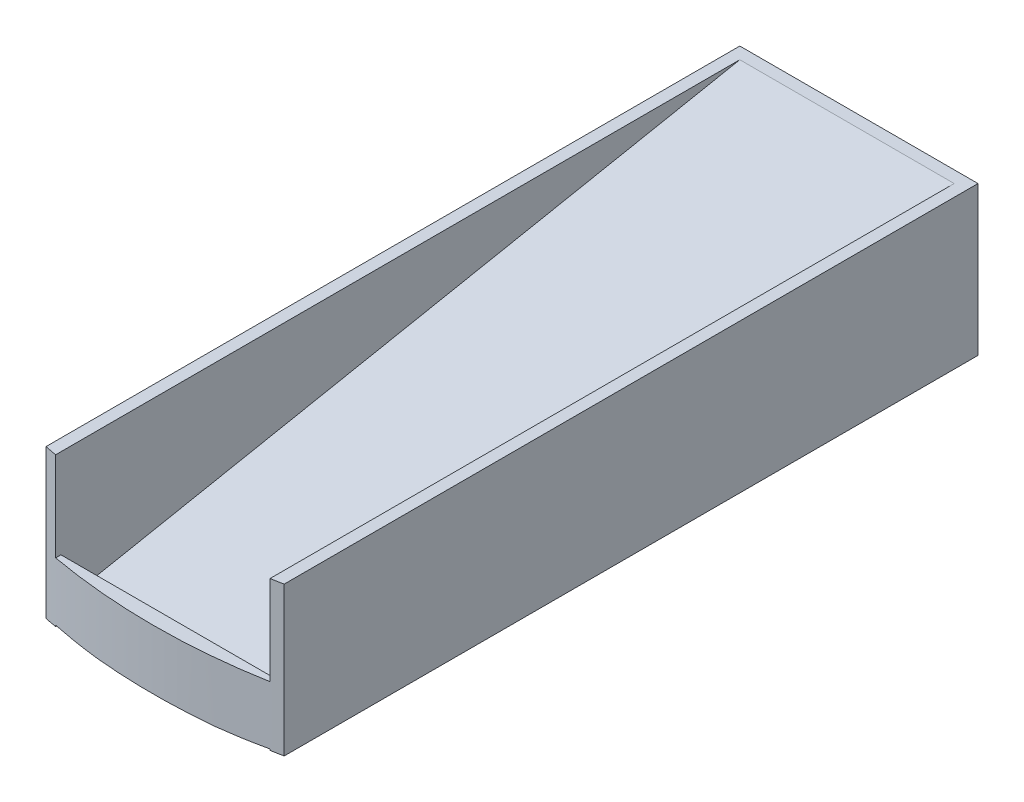
ISO-10303-21;
HEADER;
FILE_DESCRIPTION(('STEP AP214'),'2;1');
FILE_NAME('part.step','',(''),(''),'','','');
FILE_SCHEMA(('AUTOMOTIVE_DESIGN { 1 0 10303 214 1 1 1 1 }'));
ENDSEC;
DATA;
#1=APPLICATION_CONTEXT('core data for automotive mechanical design processes');
#2=APPLICATION_PROTOCOL_DEFINITION('international standard','automotive_design',2000,#1);
#3=PRODUCT_CONTEXT('',#1,'mechanical');
#4=PRODUCT('Part','Part','',(#3));
#5=PRODUCT_RELATED_PRODUCT_CATEGORY('part','',(#4));
#6=PRODUCT_DEFINITION_FORMATION('','',#4);
#7=PRODUCT_DEFINITION_CONTEXT('part definition',#1,'design');
#8=PRODUCT_DEFINITION('design','',#6,#7);
#9=PRODUCT_DEFINITION_SHAPE('','',#8);
#10=(LENGTH_UNIT() NAMED_UNIT(*) SI_UNIT(.MILLI.,.METRE.));
#11=(NAMED_UNIT(*) PLANE_ANGLE_UNIT() SI_UNIT($,.RADIAN.));
#12=(NAMED_UNIT(*) SI_UNIT($,.STERADIAN.) SOLID_ANGLE_UNIT());
#13=UNCERTAINTY_MEASURE_WITH_UNIT(LENGTH_MEASURE(1.E-05),#10,'distance_accuracy_value','');
#14=(GEOMETRIC_REPRESENTATION_CONTEXT(3) GLOBAL_UNCERTAINTY_ASSIGNED_CONTEXT((#13)) GLOBAL_UNIT_ASSIGNED_CONTEXT((#10,
#11,#12)) REPRESENTATION_CONTEXT('',''));
#15=CARTESIAN_POINT('',(0.,0.,0.));
#16=DIRECTION('',(0.,0.,1.));
#17=DIRECTION('',(1.,0.,0.));
#18=AXIS2_PLACEMENT_3D('',#15,#16,#17);
#19=CARTESIAN_POINT('',(-20.,-12.5,60.));
#20=DIRECTION('',(0.,1.,0.));
#21=DIRECTION('',(0.,0.,1.));
#22=AXIS2_PLACEMENT_3D('',#19,#20,#21);
#23=PLANE('',#22);
#24=CARTESIAN_POINT('',(0.,-12.5,-43.));
#25=DIRECTION('',(0.,1.,0.));
#26=DIRECTION('',(0.,0.,1.));
#27=AXIS2_PLACEMENT_3D('',#24,#25,#26);
#28=CIRCLE('',#27,101.5);
#29=CARTESIAN_POINT('',(18.,-12.5,56.891190802793));
#30=VERTEX_POINT('',#29);
#31=CARTESIAN_POINT('',(20.,-12.5,56.5100497437319));
#32=VERTEX_POINT('',#31);
#33=EDGE_CURVE('E157',#30,#32,#28,.T.);
#34=ORIENTED_EDGE('',*,*,#33,.F.);
#35=DIRECTION('',(0.,0.,-1.));
#36=VECTOR('',#35,1.);
#37=CARTESIAN_POINT('',(18.,-12.5,-60.));
#38=LINE('',#37,#36);
#39=CARTESIAN_POINT('',(18.,-12.5,-60.));
#40=VERTEX_POINT('',#39);
#41=EDGE_CURVE('E185',#30,#40,#38,.T.);
#42=ORIENTED_EDGE('',*,*,#41,.T.);
#43=DIRECTION('',(1.,0.,0.));
#44=VECTOR('',#43,1.);
#45=CARTESIAN_POINT('',(-20.,-12.5,-60.));
#46=LINE('',#45,#44);
#47=CARTESIAN_POINT('',(20.,-12.5,-60.));
#48=VERTEX_POINT('',#47);
#49=EDGE_CURVE('E226',#40,#48,#46,.T.);
#50=ORIENTED_EDGE('',*,*,#49,.T.);
#51=DIRECTION('',(0.,0.,-1.));
#52=VECTOR('',#51,1.);
#53=CARTESIAN_POINT('',(20.,-12.5,60.));
#54=LINE('',#53,#52);
#55=EDGE_CURVE('E231',#32,#48,#54,.T.);
#56=ORIENTED_EDGE('',*,*,#55,.F.);
#57=EDGE_LOOP('',(#34,#42,#50,#56));
#58=FACE_BOUND('',#57,.T.);
#59=ADVANCED_FACE('F43',(#58),#23,.F.);
#60=CARTESIAN_POINT('',(-20.,-12.5,56.5100497437319));
#61=VERTEX_POINT('',#60);
#62=CARTESIAN_POINT('',(-18.,-12.5,56.891190802793));
#63=VERTEX_POINT('',#62);
#64=EDGE_CURVE('E154',#61,#63,#28,.T.);
#65=ORIENTED_EDGE('',*,*,#64,.F.);
#66=DIRECTION('',(0.,0.,-1.));
#67=VECTOR('',#66,1.);
#68=CARTESIAN_POINT('',(-20.,-12.5,60.));
#69=LINE('',#68,#67);
#70=CARTESIAN_POINT('',(-20.,-12.5,-60.));
#71=VERTEX_POINT('',#70);
#72=EDGE_CURVE('E234',#61,#71,#69,.T.);
#73=ORIENTED_EDGE('',*,*,#72,.T.);
#74=CARTESIAN_POINT('',(-18.,-12.5,-60.));
#75=VERTEX_POINT('',#74);
#76=EDGE_CURVE('E227',#71,#75,#46,.T.);
#77=ORIENTED_EDGE('',*,*,#76,.T.);
#78=DIRECTION('',(0.,0.,-1.));
#79=VECTOR('',#78,1.);
#80=CARTESIAN_POINT('',(-18.,-12.5,-60.));
#81=LINE('',#80,#79);
#82=EDGE_CURVE('E181',#63,#75,#81,.T.);
#83=ORIENTED_EDGE('',*,*,#82,.F.);
#84=EDGE_LOOP('',(#65,#73,#77,#83));
#85=FACE_BOUND('',#84,.T.);
#86=ADVANCED_FACE('F307',(#85),#23,.F.);
#87=CARTESIAN_POINT('',(-10.0623058987495,-12.5,58.));
#88=VERTEX_POINT('',#87);
#89=CARTESIAN_POINT('',(10.0623058987495,-12.5,58.));
#90=VERTEX_POINT('',#89);
#91=EDGE_CURVE('E144',#88,#90,#28,.T.);
#92=ORIENTED_EDGE('',*,*,#91,.F.);
#93=DIRECTION('',(1.,0.,0.));
#94=VECTOR('',#93,1.);
#95=CARTESIAN_POINT('',(-18.,-12.5,58.));
#96=LINE('',#95,#94);
#97=EDGE_CURVE('E160',#88,#90,#96,.T.);
#98=ORIENTED_EDGE('',*,*,#97,.T.);
#99=EDGE_LOOP('',(#92,#98));
#100=FACE_BOUND('',#99,.T.);
#101=ADVANCED_FACE('F165',(#100),#23,.F.);
#102=CARTESIAN_POINT('',(20.,12.5,60.));
#103=DIRECTION('',(-1.,0.,0.));
#104=DIRECTION('',(0.,-1.,0.));
#105=AXIS2_PLACEMENT_3D('',#102,#103,#104);
#106=PLANE('',#105);
#107=DIRECTION('',(0.,1.,0.));
#108=VECTOR('',#107,1.);
#109=CARTESIAN_POINT('',(20.,-12.5,56.5100497437319));
#110=LINE('',#109,#108);
#111=CARTESIAN_POINT('',(20.,12.5,56.5100497437319));
#112=VERTEX_POINT('',#111);
#113=EDGE_CURVE('E274',#32,#112,#110,.T.);
#114=ORIENTED_EDGE('',*,*,#113,.F.);
#115=ORIENTED_EDGE('',*,*,#55,.T.);
#116=DIRECTION('',(0.,1.,0.));
#117=VECTOR('',#116,1.);
#118=CARTESIAN_POINT('',(20.,12.5,-60.));
#119=LINE('',#118,#117);
#120=CARTESIAN_POINT('',(20.,12.5,-60.));
#121=VERTEX_POINT('',#120);
#122=EDGE_CURVE('E214',#48,#121,#119,.T.);
#123=ORIENTED_EDGE('',*,*,#122,.T.);
#124=DIRECTION('',(0.,0.,-1.));
#125=VECTOR('',#124,1.);
#126=CARTESIAN_POINT('',(20.,12.5,60.));
#127=LINE('',#126,#125);
#128=EDGE_CURVE('E240',#112,#121,#127,.T.);
#129=ORIENTED_EDGE('',*,*,#128,.F.);
#130=EDGE_LOOP('',(#114,#115,#123,#129));
#131=FACE_BOUND('',#130,.T.);
#132=ADVANCED_FACE('F45',(#131),#106,.F.);
#133=CARTESIAN_POINT('',(-20.,12.5,60.));
#134=DIRECTION('',(0.,-1.,0.));
#135=DIRECTION('',(0.,0.,-1.));
#136=AXIS2_PLACEMENT_3D('',#133,#134,#135);
#137=PLANE('',#136);
#138=CARTESIAN_POINT('',(0.,12.5,-43.));
#139=DIRECTION('',(0.,1.,0.));
#140=DIRECTION('',(0.,0.,1.));
#141=AXIS2_PLACEMENT_3D('',#138,#139,#140);
#142=CIRCLE('',#141,101.5);
#143=CARTESIAN_POINT('',(18.,12.5,56.891190802793));
#144=VERTEX_POINT('',#143);
#145=EDGE_CURVE('E155',#144,#112,#142,.T.);
#146=ORIENTED_EDGE('',*,*,#145,.T.);
#147=ORIENTED_EDGE('',*,*,#128,.T.);
#148=DIRECTION('',(-1.,0.,0.));
#149=VECTOR('',#148,1.);
#150=CARTESIAN_POINT('',(-20.,12.5,-60.));
#151=LINE('',#150,#149);
#152=CARTESIAN_POINT('',(-20.,12.5,-60.));
#153=VERTEX_POINT('',#152);
#154=EDGE_CURVE('E218',#121,#153,#151,.T.);
#155=ORIENTED_EDGE('',*,*,#154,.T.);
#156=DIRECTION('',(0.,0.,-1.));
#157=VECTOR('',#156,1.);
#158=CARTESIAN_POINT('',(-20.,12.5,60.));
#159=LINE('',#158,#157);
#160=CARTESIAN_POINT('',(-20.,12.5,56.5100497437319));
#161=VERTEX_POINT('',#160);
#162=EDGE_CURVE('E237',#161,#153,#159,.T.);
#163=ORIENTED_EDGE('',*,*,#162,.F.);
#164=CARTESIAN_POINT('',(-18.,12.5,56.891190802793));
#165=VERTEX_POINT('',#164);
#166=EDGE_CURVE('E265',#161,#165,#142,.T.);
#167=ORIENTED_EDGE('',*,*,#166,.T.);
#168=DIRECTION('',(0.,0.,1.));
#169=VECTOR('',#168,1.);
#170=CARTESIAN_POINT('',(-18.,12.5,-58.));
#171=LINE('',#170,#169);
#172=CARTESIAN_POINT('',(-18.,12.5,-58.));
#173=VERTEX_POINT('',#172);
#174=EDGE_CURVE('E200',#173,#165,#171,.T.);
#175=ORIENTED_EDGE('',*,*,#174,.F.);
#176=DIRECTION('',(1.,0.,0.));
#177=VECTOR('',#176,1.);
#178=CARTESIAN_POINT('',(-18.,12.5,-58.));
#179=LINE('',#178,#177);
#180=CARTESIAN_POINT('',(18.,12.5,-58.));
#181=VERTEX_POINT('',#180);
#182=EDGE_CURVE('E205',#173,#181,#179,.T.);
#183=ORIENTED_EDGE('',*,*,#182,.T.);
#184=DIRECTION('',(0.,0.,1.));
#185=VECTOR('',#184,1.);
#186=CARTESIAN_POINT('',(18.,12.5,-58.));
#187=LINE('',#186,#185);
#188=EDGE_CURVE('E201',#181,#144,#187,.T.);
#189=ORIENTED_EDGE('',*,*,#188,.T.);
#190=EDGE_LOOP('',(#146,#147,#155,#163,#167,#175,#183,#189));
#191=FACE_BOUND('',#190,.T.);
#192=ADVANCED_FACE('F262',(#191),#137,.F.);
#193=CARTESIAN_POINT('',(-20.,12.5,60.));
#194=DIRECTION('',(1.,0.,0.));
#195=DIRECTION('',(0.,1.,0.));
#196=AXIS2_PLACEMENT_3D('',#193,#194,#195);
#197=PLANE('',#196);
#198=DIRECTION('',(0.,1.,0.));
#199=VECTOR('',#198,1.);
#200=CARTESIAN_POINT('',(-20.,-12.5,56.5100497437319));
#201=LINE('',#200,#199);
#202=EDGE_CURVE('E280',#161,#61,#201,.F.);
#203=ORIENTED_EDGE('',*,*,#202,.F.);
#204=ORIENTED_EDGE('',*,*,#162,.T.);
#205=DIRECTION('',(0.,-1.,0.));
#206=VECTOR('',#205,1.);
#207=CARTESIAN_POINT('',(-20.,12.5,-60.));
#208=LINE('',#207,#206);
#209=EDGE_CURVE('E222',#153,#71,#208,.T.);
#210=ORIENTED_EDGE('',*,*,#209,.T.);
#211=ORIENTED_EDGE('',*,*,#72,.F.);
#212=EDGE_LOOP('',(#203,#204,#210,#211));
#213=FACE_BOUND('',#212,.T.);
#214=ADVANCED_FACE('F309',(#213),#197,.F.);
#215=CARTESIAN_POINT('',(-18.,-12.5,58.));
#216=DIRECTION('',(0.,0.981528706847788,0.191314917436433));
#217=DIRECTION('',(0.,-0.191314917436433,0.981528706847788));
#218=AXIS2_PLACEMENT_3D('',#215,#216,#217);
#219=PLANE('',#218);
#220=CARTESIAN_POINT('',(0.,7.1864406779661,-43.));
#221=DIRECTION('',(0.,0.981528706847788,0.191314917436433));
#222=DIRECTION('',(0.,0.191314917436433,-0.981528706847788));
#223=AXIS2_PLACEMENT_3D('',#220,#221,#222);
#224=ELLIPSE('',#223,103.410118615859,101.5);
#225=CARTESIAN_POINT('',(-18.,-12.2838761734258,56.891190802793));
#226=VERTEX_POINT('',#225);
#227=EDGE_CURVE('E149',#226,#88,#224,.T.);
#228=ORIENTED_EDGE('',*,*,#227,.F.);
#229=DIRECTION('',(0.,-0.191314917436433,0.981528706847788));
#230=VECTOR('',#229,1.);
#231=CARTESIAN_POINT('',(-18.,-12.5,58.));
#232=LINE('',#231,#230);
#233=CARTESIAN_POINT('',(-18.,10.5,-60.));
#234=VERTEX_POINT('',#233);
#235=EDGE_CURVE('E172',#234,#226,#232,.T.);
#236=ORIENTED_EDGE('',*,*,#235,.F.);
#237=DIRECTION('',(1.,0.,0.));
#238=VECTOR('',#237,1.);
#239=CARTESIAN_POINT('',(-18.,10.5,-60.));
#240=LINE('',#239,#238);
#241=CARTESIAN_POINT('',(18.,10.5,-60.));
#242=VERTEX_POINT('',#241);
#243=EDGE_CURVE('E167',#234,#242,#240,.T.);
#244=ORIENTED_EDGE('',*,*,#243,.T.);
#245=DIRECTION('',(0.,-0.191314917436433,0.981528706847788));
#246=VECTOR('',#245,1.);
#247=CARTESIAN_POINT('',(18.,-12.5,58.));
#248=LINE('',#247,#246);
#249=CARTESIAN_POINT('',(18.,-12.2838761734258,56.891190802793));
#250=VERTEX_POINT('',#249);
#251=EDGE_CURVE('E66',#242,#250,#248,.T.);
#252=ORIENTED_EDGE('',*,*,#251,.T.);
#253=EDGE_CURVE('E147',#90,#250,#224,.T.);
#254=ORIENTED_EDGE('',*,*,#253,.F.);
#255=ORIENTED_EDGE('',*,*,#97,.F.);
#256=EDGE_LOOP('',(#228,#236,#244,#252,#254,#255));
#257=FACE_BOUND('',#256,.T.);
#258=ADVANCED_FACE('F159',(#257),#219,.F.);
#259=CARTESIAN_POINT('',(-18.,0.,0.));
#260=DIRECTION('',(1.,0.,0.));
#261=DIRECTION('',(0.,0.,-1.));
#262=AXIS2_PLACEMENT_3D('',#259,#260,#261);
#263=PLANE('',#262);
#264=ORIENTED_EDGE('',*,*,#235,.T.);
#265=DIRECTION('',(0.,1.,0.));
#266=VECTOR('',#265,1.);
#267=CARTESIAN_POINT('',(-18.,-12.5,56.891190802793));
#268=LINE('',#267,#266);
#269=EDGE_CURVE('E162',#226,#63,#268,.F.);
#270=ORIENTED_EDGE('',*,*,#269,.T.);
#271=ORIENTED_EDGE('',*,*,#82,.T.);
#272=DIRECTION('',(0.,1.,0.));
#273=VECTOR('',#272,1.);
#274=CARTESIAN_POINT('',(-18.,10.5,-60.));
#275=LINE('',#274,#273);
#276=EDGE_CURVE('E192',#75,#234,#275,.T.);
#277=ORIENTED_EDGE('',*,*,#276,.T.);
#278=EDGE_LOOP('',(#264,#270,#271,#277));
#279=FACE_BOUND('',#278,.T.);
#280=ADVANCED_FACE('F319',(#279),#263,.T.);
#281=CARTESIAN_POINT('',(18.,0.,0.));
#282=DIRECTION('',(1.,0.,0.));
#283=DIRECTION('',(0.,0.,-1.));
#284=AXIS2_PLACEMENT_3D('',#281,#282,#283);
#285=PLANE('',#284);
#286=DIRECTION('',(0.,1.,0.));
#287=VECTOR('',#286,1.);
#288=CARTESIAN_POINT('',(18.,-12.5,56.891190802793));
#289=LINE('',#288,#287);
#290=EDGE_CURVE('E163',#250,#30,#289,.F.);
#291=ORIENTED_EDGE('',*,*,#290,.F.);
#292=ORIENTED_EDGE('',*,*,#251,.F.);
#293=DIRECTION('',(0.,1.,0.));
#294=VECTOR('',#293,1.);
#295=CARTESIAN_POINT('',(18.,10.5,-60.));
#296=LINE('',#295,#294);
#297=EDGE_CURVE('E180',#40,#242,#296,.T.);
#298=ORIENTED_EDGE('',*,*,#297,.F.);
#299=ORIENTED_EDGE('',*,*,#41,.F.);
#300=EDGE_LOOP('',(#291,#292,#298,#299));
#301=FACE_BOUND('',#300,.T.);
#302=ADVANCED_FACE('F324',(#301),#285,.F.);
#303=CARTESIAN_POINT('',(-18.,0.,0.));
#304=DIRECTION('',(-1.,0.,0.));
#305=DIRECTION('',(0.,0.,1.));
#306=AXIS2_PLACEMENT_3D('',#303,#304,#305);
#307=PLANE('',#306);
#308=DIRECTION('',(0.,1.,0.));
#309=VECTOR('',#308,1.);
#310=CARTESIAN_POINT('',(-18.,-12.5,56.891190802793));
#311=LINE('',#310,#309);
#312=CARTESIAN_POINT('',(-18.,-2.5,56.891190802793));
#313=VERTEX_POINT('',#312);
#314=EDGE_CURVE('E270',#313,#165,#311,.T.);
#315=ORIENTED_EDGE('',*,*,#314,.F.);
#316=DIRECTION('',(0.,0.,1.));
#317=VECTOR('',#316,1.);
#318=CARTESIAN_POINT('',(-18.,-2.5,56.));
#319=LINE('',#318,#317);
#320=CARTESIAN_POINT('',(-18.,-2.5,56.));
#321=VERTEX_POINT('',#320);
#322=EDGE_CURVE('E175',#321,#313,#319,.T.);
#323=ORIENTED_EDGE('',*,*,#322,.F.);
#324=DIRECTION('',(0.,-1.,0.));
#325=VECTOR('',#324,1.);
#326=CARTESIAN_POINT('',(-18.,-10.5,56.));
#327=LINE('',#326,#325);
#328=CARTESIAN_POINT('',(-18.,-9.72033898305085,56.));
#329=VERTEX_POINT('',#328);
#330=EDGE_CURVE('E272',#321,#329,#327,.T.);
#331=ORIENTED_EDGE('',*,*,#330,.T.);
#332=DIRECTION('',(0.,0.191314917436433,-0.981528706847788));
#333=VECTOR('',#332,1.);
#334=CARTESIAN_POINT('',(-18.,-10.5,60.));
#335=LINE('',#334,#333);
#336=EDGE_CURVE('E197',#329,#173,#335,.T.);
#337=ORIENTED_EDGE('',*,*,#336,.T.);
#338=ORIENTED_EDGE('',*,*,#174,.T.);
#339=EDGE_LOOP('',(#315,#323,#331,#337,#338));
#340=FACE_BOUND('',#339,.T.);
#341=ADVANCED_FACE('F268',(#340),#307,.F.);
#342=CARTESIAN_POINT('',(18.,0.,0.));
#343=DIRECTION('',(-1.,0.,0.));
#344=DIRECTION('',(0.,0.,1.));
#345=AXIS2_PLACEMENT_3D('',#342,#343,#344);
#346=PLANE('',#345);
#347=DIRECTION('',(0.,0.,1.));
#348=VECTOR('',#347,1.);
#349=CARTESIAN_POINT('',(18.,-2.5,56.));
#350=LINE('',#349,#348);
#351=CARTESIAN_POINT('',(18.,-2.5,56.));
#352=VERTEX_POINT('',#351);
#353=CARTESIAN_POINT('',(18.,-2.5,56.891190802793));
#354=VERTEX_POINT('',#353);
#355=EDGE_CURVE('E278',#352,#354,#350,.T.);
#356=ORIENTED_EDGE('',*,*,#355,.T.);
#357=DIRECTION('',(0.,1.,0.));
#358=VECTOR('',#357,1.);
#359=CARTESIAN_POINT('',(18.,-12.5,56.891190802793));
#360=LINE('',#359,#358);
#361=EDGE_CURVE('E59',#354,#144,#360,.T.);
#362=ORIENTED_EDGE('',*,*,#361,.T.);
#363=ORIENTED_EDGE('',*,*,#188,.F.);
#364=DIRECTION('',(0.,0.191314917436433,-0.981528706847788));
#365=VECTOR('',#364,1.);
#366=CARTESIAN_POINT('',(18.,-10.5,60.));
#367=LINE('',#366,#365);
#368=CARTESIAN_POINT('',(18.,-9.72033898305085,56.));
#369=VERTEX_POINT('',#368);
#370=EDGE_CURVE('E188',#369,#181,#367,.T.);
#371=ORIENTED_EDGE('',*,*,#370,.F.);
#372=DIRECTION('',(0.,-1.,0.));
#373=VECTOR('',#372,1.);
#374=CARTESIAN_POINT('',(18.,0.,56.));
#375=LINE('',#374,#373);
#376=EDGE_CURVE('E52',#352,#369,#375,.T.);
#377=ORIENTED_EDGE('',*,*,#376,.F.);
#378=EDGE_LOOP('',(#356,#362,#363,#371,#377));
#379=FACE_BOUND('',#378,.T.);
#380=ADVANCED_FACE('F258',(#379),#346,.T.);
#381=CARTESIAN_POINT('',(-18.,-2.5,56.));
#382=DIRECTION('',(0.,1.,0.));
#383=DIRECTION('',(0.,0.,1.));
#384=AXIS2_PLACEMENT_3D('',#381,#382,#383);
#385=PLANE('',#384);
#386=ORIENTED_EDGE('',*,*,#322,.T.);
#387=CARTESIAN_POINT('',(0.,-2.5,-43.));
#388=DIRECTION('',(0.,1.,0.));
#389=DIRECTION('',(0.,0.,1.));
#390=AXIS2_PLACEMENT_3D('',#387,#388,#389);
#391=CIRCLE('',#390,101.5);
#392=EDGE_CURVE('E11',#313,#354,#391,.T.);
#393=ORIENTED_EDGE('',*,*,#392,.T.);
#394=ORIENTED_EDGE('',*,*,#355,.F.);
#395=DIRECTION('',(-1.,0.,0.));
#396=VECTOR('',#395,1.);
#397=CARTESIAN_POINT('',(-18.,-2.5,56.));
#398=LINE('',#397,#396);
#399=EDGE_CURVE('E249',#352,#321,#398,.T.);
#400=ORIENTED_EDGE('',*,*,#399,.T.);
#401=EDGE_LOOP('',(#386,#393,#394,#400));
#402=FACE_BOUND('',#401,.T.);
#403=ADVANCED_FACE('F288',(#402),#385,.T.);
#404=CARTESIAN_POINT('',(0.,0.,-60.));
#405=DIRECTION('',(0.,0.,1.));
#406=DIRECTION('',(1.,0.,0.));
#407=AXIS2_PLACEMENT_3D('',#404,#405,#406);
#408=PLANE('',#407);
#409=ORIENTED_EDGE('',*,*,#276,.F.);
#410=ORIENTED_EDGE('',*,*,#76,.F.);
#411=ORIENTED_EDGE('',*,*,#209,.F.);
#412=ORIENTED_EDGE('',*,*,#154,.F.);
#413=ORIENTED_EDGE('',*,*,#122,.F.);
#414=ORIENTED_EDGE('',*,*,#49,.F.);
#415=ORIENTED_EDGE('',*,*,#297,.T.);
#416=ORIENTED_EDGE('',*,*,#243,.F.);
#417=EDGE_LOOP('',(#409,#410,#411,#412,#413,#414,#415,#416));
#418=FACE_BOUND('',#417,.T.);
#419=ADVANCED_FACE('F315',(#418),#408,.F.);
#420=CARTESIAN_POINT('',(-18.,-10.5,60.));
#421=DIRECTION('',(0.,-0.981528706847788,-0.191314917436433));
#422=DIRECTION('',(0.,0.191314917436433,-0.981528706847788));
#423=AXIS2_PLACEMENT_3D('',#420,#421,#422);
#424=PLANE('',#423);
#425=ORIENTED_EDGE('',*,*,#336,.F.);
#426=DIRECTION('',(1.,0.,0.));
#427=VECTOR('',#426,1.);
#428=CARTESIAN_POINT('',(-18.,-9.72033898305085,56.));
#429=LINE('',#428,#427);
#430=EDGE_CURVE('E168',#329,#369,#429,.T.);
#431=ORIENTED_EDGE('',*,*,#430,.T.);
#432=ORIENTED_EDGE('',*,*,#370,.T.);
#433=ORIENTED_EDGE('',*,*,#182,.F.);
#434=EDGE_LOOP('',(#425,#431,#432,#433));
#435=FACE_BOUND('',#434,.T.);
#436=ADVANCED_FACE('F255',(#435),#424,.F.);
#437=CARTESIAN_POINT('',(0.,0.,56.));
#438=DIRECTION('',(0.,0.,-1.));
#439=DIRECTION('',(-1.,0.,0.));
#440=AXIS2_PLACEMENT_3D('',#437,#438,#439);
#441=PLANE('',#440);
#442=ORIENTED_EDGE('',*,*,#430,.F.);
#443=ORIENTED_EDGE('',*,*,#330,.F.);
#444=ORIENTED_EDGE('',*,*,#399,.F.);
#445=ORIENTED_EDGE('',*,*,#376,.T.);
#446=EDGE_LOOP('',(#442,#443,#444,#445));
#447=FACE_BOUND('',#446,.T.);
#448=ADVANCED_FACE('F246',(#447),#441,.T.);
#449=CARTESIAN_POINT('',(0.,-12.5,-43.));
#450=DIRECTION('',(0.,1.,0.));
#451=DIRECTION('',(0.,0.,1.));
#452=AXIS2_PLACEMENT_3D('',#449,#450,#451);
#453=CYLINDRICAL_SURFACE('',#452,101.5);
#454=ORIENTED_EDGE('',*,*,#113,.T.);
#455=ORIENTED_EDGE('',*,*,#145,.F.);
#456=ORIENTED_EDGE('',*,*,#361,.F.);
#457=ORIENTED_EDGE('',*,*,#392,.F.);
#458=ORIENTED_EDGE('',*,*,#314,.T.);
#459=ORIENTED_EDGE('',*,*,#166,.F.);
#460=ORIENTED_EDGE('',*,*,#202,.T.);
#461=ORIENTED_EDGE('',*,*,#64,.T.);
#462=ORIENTED_EDGE('',*,*,#269,.F.);
#463=ORIENTED_EDGE('',*,*,#227,.T.);
#464=ORIENTED_EDGE('',*,*,#91,.T.);
#465=ORIENTED_EDGE('',*,*,#253,.T.);
#466=ORIENTED_EDGE('',*,*,#290,.T.);
#467=ORIENTED_EDGE('',*,*,#33,.T.);
#468=EDGE_LOOP('',(#454,#455,#456,#457,#458,#459,#460,#461,#462,#463,#464,#465,#466,#467));
#469=FACE_BOUND('',#468,.T.);
#470=ADVANCED_FACE('F146',(#469),#453,.T.);
#471=CLOSED_SHELL('',(#59,#86,#101,#132,#192,#214,#258,#280,#302,#341,#380,#403,#419,#436,#448,#470));
#472=MANIFOLD_SOLID_BREP('B2',#471);
#473=ADVANCED_BREP_SHAPE_REPRESENTATION('',(#18,#472),#14);
#474=SHAPE_DEFINITION_REPRESENTATION(#9,#473);
ENDSEC;
END-ISO-10303-21;
